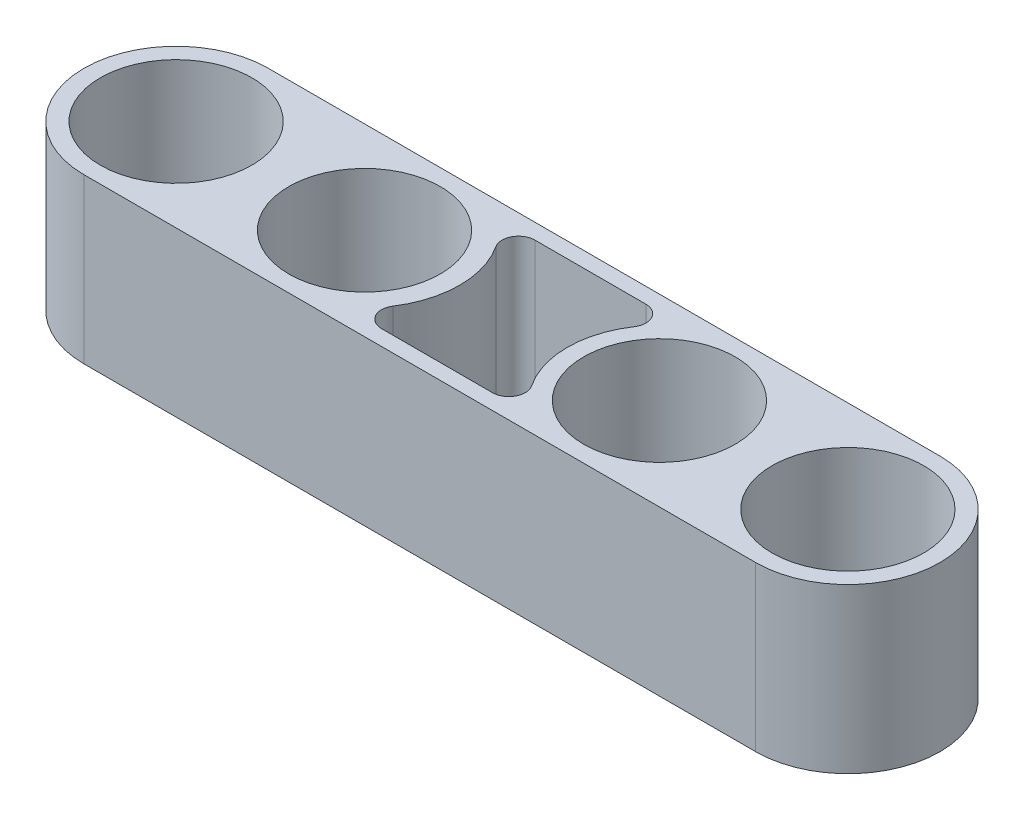
ISO-10303-21;
HEADER;
FILE_DESCRIPTION(('STEP AP214'),'2;1');
FILE_NAME('part.step','',(''),(''),'','','');
FILE_SCHEMA(('AUTOMOTIVE_DESIGN { 1 0 10303 214 1 1 1 1 }'));
ENDSEC;
DATA;
#1=APPLICATION_CONTEXT('core data for automotive mechanical design processes');
#2=APPLICATION_PROTOCOL_DEFINITION('international standard','automotive_design',2000,#1);
#3=PRODUCT_CONTEXT('',#1,'mechanical');
#4=PRODUCT('Part','Part','',(#3));
#5=PRODUCT_RELATED_PRODUCT_CATEGORY('part','',(#4));
#6=PRODUCT_DEFINITION_FORMATION('','',#4);
#7=PRODUCT_DEFINITION_CONTEXT('part definition',#1,'design');
#8=PRODUCT_DEFINITION('design','',#6,#7);
#9=PRODUCT_DEFINITION_SHAPE('','',#8);
#10=(LENGTH_UNIT() NAMED_UNIT(*) SI_UNIT(.MILLI.,.METRE.));
#11=(NAMED_UNIT(*) PLANE_ANGLE_UNIT() SI_UNIT($,.RADIAN.));
#12=(NAMED_UNIT(*) SI_UNIT($,.STERADIAN.) SOLID_ANGLE_UNIT());
#13=UNCERTAINTY_MEASURE_WITH_UNIT(LENGTH_MEASURE(1.E-05),#10,'distance_accuracy_value','');
#14=(GEOMETRIC_REPRESENTATION_CONTEXT(3) GLOBAL_UNCERTAINTY_ASSIGNED_CONTEXT((#13)) GLOBAL_UNIT_ASSIGNED_CONTEXT((#10,
#11,#12)) REPRESENTATION_CONTEXT('',''));
#15=CARTESIAN_POINT('',(0.,0.,0.));
#16=DIRECTION('',(0.,0.,1.));
#17=DIRECTION('',(1.,0.,0.));
#18=AXIS2_PLACEMENT_3D('',#15,#16,#17);
#19=CARTESIAN_POINT('',(-17.8836964666493,20.,0.));
#20=DIRECTION('',(0.,-1.,0.));
#21=DIRECTION('',(0.,0.,-1.));
#22=AXIS2_PLACEMENT_3D('',#19,#20,#21);
#23=CYLINDRICAL_SURFACE('',#22,11.5);
#24=CARTESIAN_POINT('',(-17.8836964666493,0.,0.));
#25=DIRECTION('',(0.,1.,0.));
#26=DIRECTION('',(0.,0.,1.));
#27=AXIS2_PLACEMENT_3D('',#24,#25,#26);
#28=CIRCLE('',#27,11.5);
#29=CARTESIAN_POINT('',(-8.24368220438211,0.,6.27057613168724));
#30=VERTEX_POINT('',#29);
#31=CARTESIAN_POINT('',(-8.24368220438213,0.,-6.27057613168725));
#32=VERTEX_POINT('',#31);
#33=EDGE_CURVE('E188',#30,#32,#28,.T.);
#34=ORIENTED_EDGE('',*,*,#33,.T.);
#35=DIRECTION('',(0.,-1.,0.));
#36=VECTOR('',#35,1.);
#37=CARTESIAN_POINT('',(-8.24368220438213,20.,-6.27057613168725));
#38=LINE('',#37,#36);
#39=CARTESIAN_POINT('',(-8.24368220438213,20.,-6.27057613168725));
#40=VERTEX_POINT('',#39);
#41=EDGE_CURVE('E11',#40,#32,#38,.T.);
#42=ORIENTED_EDGE('',*,*,#41,.F.);
#43=CARTESIAN_POINT('',(-17.8836964666493,20.,0.));
#44=DIRECTION('',(0.,1.,0.));
#45=DIRECTION('',(0.,0.,1.));
#46=AXIS2_PLACEMENT_3D('',#43,#44,#45);
#47=CIRCLE('',#46,11.5);
#48=CARTESIAN_POINT('',(-8.24368220438211,20.,6.27057613168724));
#49=VERTEX_POINT('',#48);
#50=EDGE_CURVE('E243',#49,#40,#47,.T.);
#51=ORIENTED_EDGE('',*,*,#50,.F.);
#52=DIRECTION('',(0.,-1.,0.));
#53=VECTOR('',#52,1.);
#54=CARTESIAN_POINT('',(-8.24368220438211,20.,6.27057613168724));
#55=LINE('',#54,#53);
#56=EDGE_CURVE('E207',#49,#30,#55,.T.);
#57=ORIENTED_EDGE('',*,*,#56,.T.);
#58=EDGE_LOOP('',(#34,#42,#51,#57));
#59=FACE_BOUND('',#58,.T.);
#60=ADVANCED_FACE('F41',(#59),#23,.T.);
#61=CARTESIAN_POINT('',(-6.56715798485741,20.,-7.36111111111112));
#62=DIRECTION('',(0.,-1.,0.));
#63=DIRECTION('',(0.,0.,-1.));
#64=AXIS2_PLACEMENT_3D('',#61,#62,#63);
#65=CYLINDRICAL_SURFACE('',#64,2.);
#66=CARTESIAN_POINT('',(-6.56715798485741,0.,-7.36111111111112));
#67=DIRECTION('',(0.,1.,0.));
#68=DIRECTION('',(0.,0.,1.));
#69=AXIS2_PLACEMENT_3D('',#66,#67,#68);
#70=CIRCLE('',#69,2.);
#71=CARTESIAN_POINT('',(-6.56715798485741,0.,-9.36111111111112));
#72=VERTEX_POINT('',#71);
#73=EDGE_CURVE('E191',#32,#72,#70,.F.);
#74=ORIENTED_EDGE('',*,*,#73,.T.);
#75=DIRECTION('',(0.,-1.,0.));
#76=VECTOR('',#75,1.);
#77=CARTESIAN_POINT('',(-6.56715798485741,20.,-9.36111111111112));
#78=LINE('',#77,#76);
#79=CARTESIAN_POINT('',(-6.56715798485741,20.,-9.36111111111112));
#80=VERTEX_POINT('',#79);
#81=EDGE_CURVE('E51',#80,#72,#78,.T.);
#82=ORIENTED_EDGE('',*,*,#81,.F.);
#83=CARTESIAN_POINT('',(-6.56715798485741,20.,-7.36111111111112));
#84=DIRECTION('',(0.,1.,0.));
#85=DIRECTION('',(0.,0.,1.));
#86=AXIS2_PLACEMENT_3D('',#83,#84,#85);
#87=CIRCLE('',#86,2.);
#88=EDGE_CURVE('E251',#40,#80,#87,.F.);
#89=ORIENTED_EDGE('',*,*,#88,.F.);
#90=ORIENTED_EDGE('',*,*,#41,.T.);
#91=EDGE_LOOP('',(#74,#82,#89,#90));
#92=FACE_BOUND('',#91,.T.);
#93=ADVANCED_FACE('F279',(#92),#65,.F.);
#94=CARTESIAN_POINT('',(0.,20.,-9.36111111111112));
#95=DIRECTION('',(0.,0.,-1.));
#96=DIRECTION('',(-1.,0.,0.));
#97=AXIS2_PLACEMENT_3D('',#94,#95,#96);
#98=PLANE('',#97);
#99=DIRECTION('',(1.,0.,0.));
#100=VECTOR('',#99,1.);
#101=CARTESIAN_POINT('',(0.,0.,-9.36111111111112));
#102=LINE('',#101,#100);
#103=CARTESIAN_POINT('',(6.98289769449895,0.,-9.36111111111112));
#104=VERTEX_POINT('',#103);
#105=EDGE_CURVE('E193',#72,#104,#102,.T.);
#106=ORIENTED_EDGE('',*,*,#105,.T.);
#107=DIRECTION('',(0.,-1.,0.));
#108=VECTOR('',#107,1.);
#109=CARTESIAN_POINT('',(6.98289769449895,20.,-9.36111111111112));
#110=LINE('',#109,#108);
#111=CARTESIAN_POINT('',(6.98289769449895,20.,-9.36111111111112));
#112=VERTEX_POINT('',#111);
#113=EDGE_CURVE('E213',#112,#104,#110,.T.);
#114=ORIENTED_EDGE('',*,*,#113,.F.);
#115=DIRECTION('',(1.,0.,0.));
#116=VECTOR('',#115,1.);
#117=CARTESIAN_POINT('',(0.,20.,-9.36111111111112));
#118=LINE('',#117,#116);
#119=EDGE_CURVE('E253',#80,#112,#118,.T.);
#120=ORIENTED_EDGE('',*,*,#119,.F.);
#121=ORIENTED_EDGE('',*,*,#81,.T.);
#122=EDGE_LOOP('',(#106,#114,#120,#121));
#123=FACE_BOUND('',#122,.T.);
#124=ADVANCED_FACE('F264',(#123),#98,.F.);
#125=CARTESIAN_POINT('',(6.98289769449895,20.,-7.36111111111112));
#126=DIRECTION('',(0.,-1.,0.));
#127=DIRECTION('',(0.,0.,-1.));
#128=AXIS2_PLACEMENT_3D('',#125,#126,#127);
#129=CYLINDRICAL_SURFACE('',#128,2.);
#130=CARTESIAN_POINT('',(6.98289769449895,0.,-7.36111111111112));
#131=DIRECTION('',(0.,1.,0.));
#132=DIRECTION('',(0.,0.,1.));
#133=AXIS2_PLACEMENT_3D('',#130,#131,#132);
#134=CIRCLE('',#133,2.);
#135=CARTESIAN_POINT('',(8.64585653306515,0.,-6.25000000000002));
#136=VERTEX_POINT('',#135);
#137=EDGE_CURVE('E196',#136,#104,#134,.T.);
#138=ORIENTED_EDGE('',*,*,#137,.F.);
#139=DIRECTION('',(0.,-1.,0.));
#140=VECTOR('',#139,1.);
#141=CARTESIAN_POINT('',(8.64585653306515,20.,-6.25000000000002));
#142=LINE('',#141,#140);
#143=CARTESIAN_POINT('',(8.64585653306515,20.,-6.25000000000002));
#144=VERTEX_POINT('',#143);
#145=EDGE_CURVE('E211',#144,#136,#142,.T.);
#146=ORIENTED_EDGE('',*,*,#145,.F.);
#147=CARTESIAN_POINT('',(6.98289769449895,20.,-7.36111111111112));
#148=DIRECTION('',(0.,1.,0.));
#149=DIRECTION('',(0.,0.,1.));
#150=AXIS2_PLACEMENT_3D('',#147,#148,#149);
#151=CIRCLE('',#150,2.);
#152=EDGE_CURVE('E255',#144,#112,#151,.T.);
#153=ORIENTED_EDGE('',*,*,#152,.T.);
#154=ORIENTED_EDGE('',*,*,#113,.T.);
#155=EDGE_LOOP('',(#138,#146,#153,#154));
#156=FACE_BOUND('',#155,.T.);
#157=ADVANCED_FACE('F259',(#156),#129,.F.);
#158=CARTESIAN_POINT('',(18.,20.,0.));
#159=DIRECTION('',(0.,-1.,0.));
#160=DIRECTION('',(0.,0.,-1.));
#161=AXIS2_PLACEMENT_3D('',#158,#159,#160);
#162=CYLINDRICAL_SURFACE('',#161,11.25);
#163=CARTESIAN_POINT('',(18.,0.,0.));
#164=DIRECTION('',(0.,1.,0.));
#165=DIRECTION('',(0.,0.,1.));
#166=AXIS2_PLACEMENT_3D('',#163,#164,#165);
#167=CIRCLE('',#166,11.25);
#168=CARTESIAN_POINT('',(8.64585653306514,0.,6.24999999999999));
#169=VERTEX_POINT('',#168);
#170=EDGE_CURVE('E199',#136,#169,#167,.T.);
#171=ORIENTED_EDGE('',*,*,#170,.T.);
#172=DIRECTION('',(0.,-1.,0.));
#173=VECTOR('',#172,1.);
#174=CARTESIAN_POINT('',(8.64585653306514,20.,6.24999999999999));
#175=LINE('',#174,#173);
#176=CARTESIAN_POINT('',(8.64585653306514,20.,6.24999999999999));
#177=VERTEX_POINT('',#176);
#178=EDGE_CURVE('E150',#177,#169,#175,.T.);
#179=ORIENTED_EDGE('',*,*,#178,.F.);
#180=CARTESIAN_POINT('',(18.,20.,0.));
#181=DIRECTION('',(0.,1.,0.));
#182=DIRECTION('',(0.,0.,1.));
#183=AXIS2_PLACEMENT_3D('',#180,#181,#182);
#184=CIRCLE('',#183,11.25);
#185=EDGE_CURVE('E156',#144,#177,#184,.T.);
#186=ORIENTED_EDGE('',*,*,#185,.F.);
#187=ORIENTED_EDGE('',*,*,#145,.T.);
#188=EDGE_LOOP('',(#171,#179,#186,#187));
#189=FACE_BOUND('',#188,.T.);
#190=ADVANCED_FACE('F269',(#189),#162,.T.);
#191=CARTESIAN_POINT('',(6.98289769449895,20.,7.3611111111111));
#192=DIRECTION('',(0.,-1.,0.));
#193=DIRECTION('',(0.,0.,-1.));
#194=AXIS2_PLACEMENT_3D('',#191,#192,#193);
#195=CYLINDRICAL_SURFACE('',#194,2.);
#196=CARTESIAN_POINT('',(6.98289769449895,0.,7.3611111111111));
#197=DIRECTION('',(0.,1.,0.));
#198=DIRECTION('',(0.,0.,1.));
#199=AXIS2_PLACEMENT_3D('',#196,#197,#198);
#200=CIRCLE('',#199,2.);
#201=CARTESIAN_POINT('',(6.98289769449895,0.,9.3611111111111));
#202=VERTEX_POINT('',#201);
#203=EDGE_CURVE('E145',#202,#169,#200,.T.);
#204=ORIENTED_EDGE('',*,*,#203,.F.);
#205=DIRECTION('',(0.,-1.,0.));
#206=VECTOR('',#205,1.);
#207=CARTESIAN_POINT('',(6.98289769449895,20.,9.3611111111111));
#208=LINE('',#207,#206);
#209=CARTESIAN_POINT('',(6.98289769449895,20.,9.3611111111111));
#210=VERTEX_POINT('',#209);
#211=EDGE_CURVE('E140',#210,#202,#208,.T.);
#212=ORIENTED_EDGE('',*,*,#211,.F.);
#213=CARTESIAN_POINT('',(6.98289769449895,20.,7.3611111111111));
#214=DIRECTION('',(0.,1.,0.));
#215=DIRECTION('',(0.,0.,1.));
#216=AXIS2_PLACEMENT_3D('',#213,#214,#215);
#217=CIRCLE('',#216,2.);
#218=EDGE_CURVE('E143',#210,#177,#217,.T.);
#219=ORIENTED_EDGE('',*,*,#218,.T.);
#220=ORIENTED_EDGE('',*,*,#178,.T.);
#221=EDGE_LOOP('',(#204,#212,#219,#220));
#222=FACE_BOUND('',#221,.T.);
#223=ADVANCED_FACE('F142',(#222),#195,.F.);
#224=CARTESIAN_POINT('',(0.,20.,9.3611111111111));
#225=DIRECTION('',(0.,0.,-1.));
#226=DIRECTION('',(-1.,0.,0.));
#227=AXIS2_PLACEMENT_3D('',#224,#225,#226);
#228=PLANE('',#227);
#229=DIRECTION('',(1.,0.,0.));
#230=VECTOR('',#229,1.);
#231=CARTESIAN_POINT('',(0.,0.,9.3611111111111));
#232=LINE('',#231,#230);
#233=CARTESIAN_POINT('',(-6.56715798485738,0.,9.3611111111111));
#234=VERTEX_POINT('',#233);
#235=EDGE_CURVE('E203',#234,#202,#232,.T.);
#236=ORIENTED_EDGE('',*,*,#235,.F.);
#237=DIRECTION('',(0.,-1.,0.));
#238=VECTOR('',#237,1.);
#239=CARTESIAN_POINT('',(-6.56715798485738,20.,9.3611111111111));
#240=LINE('',#239,#238);
#241=CARTESIAN_POINT('',(-6.56715798485738,20.,9.3611111111111));
#242=VERTEX_POINT('',#241);
#243=EDGE_CURVE('E100',#242,#234,#240,.T.);
#244=ORIENTED_EDGE('',*,*,#243,.F.);
#245=DIRECTION('',(1.,0.,0.));
#246=VECTOR('',#245,1.);
#247=CARTESIAN_POINT('',(0.,20.,9.3611111111111));
#248=LINE('',#247,#246);
#249=EDGE_CURVE('E153',#242,#210,#248,.T.);
#250=ORIENTED_EDGE('',*,*,#249,.T.);
#251=ORIENTED_EDGE('',*,*,#211,.T.);
#252=EDGE_LOOP('',(#236,#244,#250,#251));
#253=FACE_BOUND('',#252,.T.);
#254=ADVANCED_FACE('F159',(#253),#228,.T.);
#255=CARTESIAN_POINT('',(0.,20.,11.25));
#256=DIRECTION('',(0.,0.,-1.));
#257=DIRECTION('',(-1.,0.,0.));
#258=AXIS2_PLACEMENT_3D('',#255,#256,#257);
#259=PLANE('',#258);
#260=DIRECTION('',(1.,0.,0.));
#261=VECTOR('',#260,1.);
#262=CARTESIAN_POINT('',(0.,0.,11.25));
#263=LINE('',#262,#261);
#264=CARTESIAN_POINT('',(-41.,0.,11.25));
#265=VERTEX_POINT('',#264);
#266=CARTESIAN_POINT('',(41.,0.,11.25));
#267=VERTEX_POINT('',#266);
#268=EDGE_CURVE('E177',#265,#267,#263,.T.);
#269=ORIENTED_EDGE('',*,*,#268,.T.);
#270=DIRECTION('',(0.,-1.,0.));
#271=VECTOR('',#270,1.);
#272=CARTESIAN_POINT('',(41.,20.,11.25));
#273=LINE('',#272,#271);
#274=CARTESIAN_POINT('',(41.,20.,11.25));
#275=VERTEX_POINT('',#274);
#276=EDGE_CURVE('E45',#275,#267,#273,.T.);
#277=ORIENTED_EDGE('',*,*,#276,.F.);
#278=DIRECTION('',(1.,0.,0.));
#279=VECTOR('',#278,1.);
#280=CARTESIAN_POINT('',(0.,20.,11.25));
#281=LINE('',#280,#279);
#282=CARTESIAN_POINT('',(-41.,20.,11.25));
#283=VERTEX_POINT('',#282);
#284=EDGE_CURVE('E246',#283,#275,#281,.T.);
#285=ORIENTED_EDGE('',*,*,#284,.F.);
#286=DIRECTION('',(0.,-1.,0.));
#287=VECTOR('',#286,1.);
#288=CARTESIAN_POINT('',(-41.,20.,11.25));
#289=LINE('',#288,#287);
#290=EDGE_CURVE('E161',#283,#265,#289,.T.);
#291=ORIENTED_EDGE('',*,*,#290,.T.);
#292=EDGE_LOOP('',(#269,#277,#285,#291));
#293=FACE_BOUND('',#292,.T.);
#294=ADVANCED_FACE('F229',(#293),#259,.F.);
#295=CARTESIAN_POINT('',(41.,20.,0.));
#296=DIRECTION('',(0.,-1.,0.));
#297=DIRECTION('',(0.,0.,-1.));
#298=AXIS2_PLACEMENT_3D('',#295,#296,#297);
#299=CYLINDRICAL_SURFACE('',#298,11.25);
#300=CARTESIAN_POINT('',(41.,0.,0.));
#301=DIRECTION('',(0.,1.,0.));
#302=DIRECTION('',(0.,0.,1.));
#303=AXIS2_PLACEMENT_3D('',#300,#301,#302);
#304=CIRCLE('',#303,11.25);
#305=CARTESIAN_POINT('',(41.,0.,-11.25));
#306=VERTEX_POINT('',#305);
#307=EDGE_CURVE('E180',#267,#306,#304,.T.);
#308=ORIENTED_EDGE('',*,*,#307,.T.);
#309=DIRECTION('',(0.,-1.,0.));
#310=VECTOR('',#309,1.);
#311=CARTESIAN_POINT('',(41.,20.,-11.25));
#312=LINE('',#311,#310);
#313=CARTESIAN_POINT('',(41.,20.,-11.25));
#314=VERTEX_POINT('',#313);
#315=EDGE_CURVE('E220',#314,#306,#312,.T.);
#316=ORIENTED_EDGE('',*,*,#315,.F.);
#317=CARTESIAN_POINT('',(41.,20.,0.));
#318=DIRECTION('',(0.,1.,0.));
#319=DIRECTION('',(0.,0.,1.));
#320=AXIS2_PLACEMENT_3D('',#317,#318,#319);
#321=CIRCLE('',#320,11.25);
#322=EDGE_CURVE('E112',#275,#314,#321,.T.);
#323=ORIENTED_EDGE('',*,*,#322,.F.);
#324=ORIENTED_EDGE('',*,*,#276,.T.);
#325=EDGE_LOOP('',(#308,#316,#323,#324));
#326=FACE_BOUND('',#325,.T.);
#327=ADVANCED_FACE('F225',(#326),#299,.T.);
#328=CARTESIAN_POINT('',(0.,20.,-11.25));
#329=DIRECTION('',(0.,0.,-1.));
#330=DIRECTION('',(-1.,0.,0.));
#331=AXIS2_PLACEMENT_3D('',#328,#329,#330);
#332=PLANE('',#331);
#333=DIRECTION('',(1.,0.,0.));
#334=VECTOR('',#333,1.);
#335=CARTESIAN_POINT('',(0.,0.,-11.25));
#336=LINE('',#335,#334);
#337=CARTESIAN_POINT('',(-41.,0.,-11.25));
#338=VERTEX_POINT('',#337);
#339=EDGE_CURVE('E183',#338,#306,#336,.T.);
#340=ORIENTED_EDGE('',*,*,#339,.F.);
#341=DIRECTION('',(0.,-1.,0.));
#342=VECTOR('',#341,1.);
#343=CARTESIAN_POINT('',(-41.,20.,-11.25));
#344=LINE('',#343,#342);
#345=CARTESIAN_POINT('',(-41.,20.,-11.25));
#346=VERTEX_POINT('',#345);
#347=EDGE_CURVE('E219',#346,#338,#344,.T.);
#348=ORIENTED_EDGE('',*,*,#347,.F.);
#349=DIRECTION('',(1.,0.,0.));
#350=VECTOR('',#349,1.);
#351=CARTESIAN_POINT('',(0.,20.,-11.25));
#352=LINE('',#351,#350);
#353=EDGE_CURVE('E238',#346,#314,#352,.T.);
#354=ORIENTED_EDGE('',*,*,#353,.T.);
#355=ORIENTED_EDGE('',*,*,#315,.T.);
#356=EDGE_LOOP('',(#340,#348,#354,#355));
#357=FACE_BOUND('',#356,.T.);
#358=ADVANCED_FACE('F235',(#357),#332,.T.);
#359=CARTESIAN_POINT('',(-41.,20.,0.));
#360=DIRECTION('',(0.,-1.,0.));
#361=DIRECTION('',(0.,0.,-1.));
#362=AXIS2_PLACEMENT_3D('',#359,#360,#361);
#363=CYLINDRICAL_SURFACE('',#362,11.25);
#364=CARTESIAN_POINT('',(-41.,0.,0.));
#365=DIRECTION('',(0.,1.,0.));
#366=DIRECTION('',(0.,0.,1.));
#367=AXIS2_PLACEMENT_3D('',#364,#365,#366);
#368=CIRCLE('',#367,11.25);
#369=EDGE_CURVE('E186',#338,#265,#368,.T.);
#370=ORIENTED_EDGE('',*,*,#369,.T.);
#371=ORIENTED_EDGE('',*,*,#290,.F.);
#372=CARTESIAN_POINT('',(-41.,20.,0.));
#373=DIRECTION('',(0.,1.,0.));
#374=DIRECTION('',(0.,0.,1.));
#375=AXIS2_PLACEMENT_3D('',#372,#373,#374);
#376=CIRCLE('',#375,11.25);
#377=EDGE_CURVE('E240',#346,#283,#376,.T.);
#378=ORIENTED_EDGE('',*,*,#377,.F.);
#379=ORIENTED_EDGE('',*,*,#347,.T.);
#380=EDGE_LOOP('',(#370,#371,#378,#379));
#381=FACE_BOUND('',#380,.T.);
#382=ADVANCED_FACE('F241',(#381),#363,.T.);
#383=CARTESIAN_POINT('',(41.,20.,0.));
#384=DIRECTION('',(0.,-1.,0.));
#385=DIRECTION('',(0.,0.,-1.));
#386=AXIS2_PLACEMENT_3D('',#383,#384,#385);
#387=CYLINDRICAL_SURFACE('',#386,9.25);
#388=CARTESIAN_POINT('',(41.,20.,0.));
#389=DIRECTION('',(0.,1.,0.));
#390=DIRECTION('',(0.,0.,1.));
#391=AXIS2_PLACEMENT_3D('',#388,#389,#390);
#392=CIRCLE('',#391,9.25);
#393=CARTESIAN_POINT('',(41.,20.,9.24999999999999));
#394=VERTEX_POINT('',#393);
#395=EDGE_CURVE('E473',#394,#394,#392,.T.);
#396=ORIENTED_EDGE('',*,*,#395,.T.);
#397=EDGE_LOOP('',(#396));
#398=FACE_BOUND('',#397,.T.);
#399=CARTESIAN_POINT('',(41.,0.,0.));
#400=DIRECTION('',(0.,1.,0.));
#401=DIRECTION('',(0.,0.,1.));
#402=AXIS2_PLACEMENT_3D('',#399,#400,#401);
#403=CIRCLE('',#402,9.25);
#404=CARTESIAN_POINT('',(41.,0.,9.24999999999999));
#405=VERTEX_POINT('',#404);
#406=EDGE_CURVE('E174',#405,#405,#403,.T.);
#407=ORIENTED_EDGE('',*,*,#406,.F.);
#408=EDGE_LOOP('',(#407));
#409=FACE_BOUND('',#408,.T.);
#410=ADVANCED_FACE('F291',(#398,#409),#387,.F.);
#411=CARTESIAN_POINT('',(18.,20.,0.));
#412=DIRECTION('',(0.,-1.,0.));
#413=DIRECTION('',(0.,0.,-1.));
#414=AXIS2_PLACEMENT_3D('',#411,#412,#413);
#415=CYLINDRICAL_SURFACE('',#414,9.25);
#416=CARTESIAN_POINT('',(18.,20.,0.));
#417=DIRECTION('',(0.,1.,0.));
#418=DIRECTION('',(0.,0.,1.));
#419=AXIS2_PLACEMENT_3D('',#416,#417,#418);
#420=CIRCLE('',#419,9.25);
#421=CARTESIAN_POINT('',(18.,20.,9.24999999999999));
#422=VERTEX_POINT('',#421);
#423=EDGE_CURVE('E470',#422,#422,#420,.T.);
#424=ORIENTED_EDGE('',*,*,#423,.T.);
#425=EDGE_LOOP('',(#424));
#426=FACE_BOUND('',#425,.T.);
#427=CARTESIAN_POINT('',(18.,0.,0.));
#428=DIRECTION('',(0.,1.,0.));
#429=DIRECTION('',(0.,0.,1.));
#430=AXIS2_PLACEMENT_3D('',#427,#428,#429);
#431=CIRCLE('',#430,9.25);
#432=CARTESIAN_POINT('',(18.,0.,9.24999999999999));
#433=VERTEX_POINT('',#432);
#434=EDGE_CURVE('E171',#433,#433,#431,.T.);
#435=ORIENTED_EDGE('',*,*,#434,.F.);
#436=EDGE_LOOP('',(#435));
#437=FACE_BOUND('',#436,.T.);
#438=ADVANCED_FACE('F300',(#426,#437),#415,.F.);
#439=CARTESIAN_POINT('',(-18.,20.,0.));
#440=DIRECTION('',(0.,-1.,0.));
#441=DIRECTION('',(0.,0.,-1.));
#442=AXIS2_PLACEMENT_3D('',#439,#440,#441);
#443=CYLINDRICAL_SURFACE('',#442,9.25);
#444=CARTESIAN_POINT('',(-18.,20.,0.));
#445=DIRECTION('',(0.,1.,0.));
#446=DIRECTION('',(0.,0.,1.));
#447=AXIS2_PLACEMENT_3D('',#444,#445,#446);
#448=CIRCLE('',#447,9.25);
#449=CARTESIAN_POINT('',(-18.,20.,9.25));
#450=VERTEX_POINT('',#449);
#451=EDGE_CURVE('E315',#450,#450,#448,.T.);
#452=ORIENTED_EDGE('',*,*,#451,.T.);
#453=EDGE_LOOP('',(#452));
#454=FACE_BOUND('',#453,.T.);
#455=CARTESIAN_POINT('',(-18.,0.,0.));
#456=DIRECTION('',(0.,1.,0.));
#457=DIRECTION('',(0.,0.,1.));
#458=AXIS2_PLACEMENT_3D('',#455,#456,#457);
#459=CIRCLE('',#458,9.25);
#460=CARTESIAN_POINT('',(-18.,0.,9.25));
#461=VERTEX_POINT('',#460);
#462=EDGE_CURVE('E168',#461,#461,#459,.T.);
#463=ORIENTED_EDGE('',*,*,#462,.F.);
#464=EDGE_LOOP('',(#463));
#465=FACE_BOUND('',#464,.T.);
#466=ADVANCED_FACE('F303',(#454,#465),#443,.F.);
#467=CARTESIAN_POINT('',(-41.,20.,0.));
#468=DIRECTION('',(0.,-1.,0.));
#469=DIRECTION('',(0.,0.,-1.));
#470=AXIS2_PLACEMENT_3D('',#467,#468,#469);
#471=CYLINDRICAL_SURFACE('',#470,9.25);
#472=CARTESIAN_POINT('',(-41.,20.,0.));
#473=DIRECTION('',(0.,1.,0.));
#474=DIRECTION('',(0.,0.,1.));
#475=AXIS2_PLACEMENT_3D('',#472,#473,#474);
#476=CIRCLE('',#475,9.25);
#477=CARTESIAN_POINT('',(-41.,20.,9.25));
#478=VERTEX_POINT('',#477);
#479=EDGE_CURVE('E206',#478,#478,#476,.T.);
#480=ORIENTED_EDGE('',*,*,#479,.T.);
#481=EDGE_LOOP('',(#480));
#482=FACE_BOUND('',#481,.T.);
#483=CARTESIAN_POINT('',(-41.,0.,0.));
#484=DIRECTION('',(0.,1.,0.));
#485=DIRECTION('',(0.,0.,1.));
#486=AXIS2_PLACEMENT_3D('',#483,#484,#485);
#487=CIRCLE('',#486,9.25);
#488=CARTESIAN_POINT('',(-41.,0.,9.25));
#489=VERTEX_POINT('',#488);
#490=EDGE_CURVE('E165',#489,#489,#487,.T.);
#491=ORIENTED_EDGE('',*,*,#490,.F.);
#492=EDGE_LOOP('',(#491));
#493=FACE_BOUND('',#492,.T.);
#494=ADVANCED_FACE('F43',(#482,#493),#471,.F.);
#495=CARTESIAN_POINT('',(-6.56715798485738,20.,7.3611111111111));
#496=DIRECTION('',(0.,-1.,0.));
#497=DIRECTION('',(0.,0.,-1.));
#498=AXIS2_PLACEMENT_3D('',#495,#496,#497);
#499=CYLINDRICAL_SURFACE('',#498,2.);
#500=CARTESIAN_POINT('',(-6.56715798485738,0.,7.3611111111111));
#501=DIRECTION('',(0.,1.,0.));
#502=DIRECTION('',(0.,0.,1.));
#503=AXIS2_PLACEMENT_3D('',#500,#501,#502);
#504=CIRCLE('',#503,2.);
#505=EDGE_CURVE('E103',#234,#30,#504,.F.);
#506=ORIENTED_EDGE('',*,*,#505,.T.);
#507=ORIENTED_EDGE('',*,*,#56,.F.);
#508=CARTESIAN_POINT('',(-6.56715798485738,20.,7.3611111111111));
#509=DIRECTION('',(0.,1.,0.));
#510=DIRECTION('',(0.,0.,1.));
#511=AXIS2_PLACEMENT_3D('',#508,#509,#510);
#512=CIRCLE('',#511,2.);
#513=EDGE_CURVE('E60',#242,#49,#512,.F.);
#514=ORIENTED_EDGE('',*,*,#513,.F.);
#515=ORIENTED_EDGE('',*,*,#243,.T.);
#516=EDGE_LOOP('',(#506,#507,#514,#515));
#517=FACE_BOUND('',#516,.T.);
#518=ADVANCED_FACE('F310',(#517),#499,.F.);
#519=CARTESIAN_POINT('',(0.,20.,0.));
#520=DIRECTION('',(0.,1.,0.));
#521=DIRECTION('',(0.,0.,1.));
#522=AXIS2_PLACEMENT_3D('',#519,#520,#521);
#523=PLANE('',#522);
#524=ORIENTED_EDGE('',*,*,#479,.F.);
#525=EDGE_LOOP('',(#524));
#526=FACE_BOUND('',#525,.T.);
#527=ORIENTED_EDGE('',*,*,#451,.F.);
#528=EDGE_LOOP('',(#527));
#529=FACE_BOUND('',#528,.T.);
#530=ORIENTED_EDGE('',*,*,#423,.F.);
#531=EDGE_LOOP('',(#530));
#532=FACE_BOUND('',#531,.T.);
#533=ORIENTED_EDGE('',*,*,#395,.F.);
#534=EDGE_LOOP('',(#533));
#535=FACE_BOUND('',#534,.T.);
#536=ORIENTED_EDGE('',*,*,#284,.T.);
#537=ORIENTED_EDGE('',*,*,#322,.T.);
#538=ORIENTED_EDGE('',*,*,#353,.F.);
#539=ORIENTED_EDGE('',*,*,#377,.T.);
#540=EDGE_LOOP('',(#536,#537,#538,#539));
#541=FACE_BOUND('',#540,.T.);
#542=ORIENTED_EDGE('',*,*,#50,.T.);
#543=ORIENTED_EDGE('',*,*,#88,.T.);
#544=ORIENTED_EDGE('',*,*,#119,.T.);
#545=ORIENTED_EDGE('',*,*,#152,.F.);
#546=ORIENTED_EDGE('',*,*,#185,.T.);
#547=ORIENTED_EDGE('',*,*,#218,.F.);
#548=ORIENTED_EDGE('',*,*,#249,.F.);
#549=ORIENTED_EDGE('',*,*,#513,.T.);
#550=EDGE_LOOP('',(#542,#543,#544,#545,#546,#547,#548,#549));
#551=FACE_BOUND('',#550,.T.);
#552=ADVANCED_FACE('F152',(#526,#529,#532,#535,#541,#551),#523,.T.);
#553=CARTESIAN_POINT('',(0.,0.,0.));
#554=DIRECTION('',(0.,1.,0.));
#555=DIRECTION('',(0.,0.,1.));
#556=AXIS2_PLACEMENT_3D('',#553,#554,#555);
#557=PLANE('',#556);
#558=ORIENTED_EDGE('',*,*,#490,.T.);
#559=EDGE_LOOP('',(#558));
#560=FACE_BOUND('',#559,.T.);
#561=ORIENTED_EDGE('',*,*,#462,.T.);
#562=EDGE_LOOP('',(#561));
#563=FACE_BOUND('',#562,.T.);
#564=ORIENTED_EDGE('',*,*,#434,.T.);
#565=EDGE_LOOP('',(#564));
#566=FACE_BOUND('',#565,.T.);
#567=ORIENTED_EDGE('',*,*,#406,.T.);
#568=EDGE_LOOP('',(#567));
#569=FACE_BOUND('',#568,.T.);
#570=ORIENTED_EDGE('',*,*,#268,.F.);
#571=ORIENTED_EDGE('',*,*,#369,.F.);
#572=ORIENTED_EDGE('',*,*,#339,.T.);
#573=ORIENTED_EDGE('',*,*,#307,.F.);
#574=EDGE_LOOP('',(#570,#571,#572,#573));
#575=FACE_BOUND('',#574,.T.);
#576=ORIENTED_EDGE('',*,*,#33,.F.);
#577=ORIENTED_EDGE('',*,*,#505,.F.);
#578=ORIENTED_EDGE('',*,*,#235,.T.);
#579=ORIENTED_EDGE('',*,*,#203,.T.);
#580=ORIENTED_EDGE('',*,*,#170,.F.);
#581=ORIENTED_EDGE('',*,*,#137,.T.);
#582=ORIENTED_EDGE('',*,*,#105,.F.);
#583=ORIENTED_EDGE('',*,*,#73,.F.);
#584=EDGE_LOOP('',(#576,#577,#578,#579,#580,#581,#582,#583));
#585=FACE_BOUND('',#584,.T.);
#586=ADVANCED_FACE('F233',(#560,#563,#566,#569,#575,#585),#557,.F.);
#587=CLOSED_SHELL('',(#60,#93,#124,#157,#190,#223,#254,#294,#327,#358,#382,#410,#438,#466,#494,
#518,#552,#586));
#588=MANIFOLD_SOLID_BREP('B2',#587);
#589=ADVANCED_BREP_SHAPE_REPRESENTATION('',(#18,#588),#14);
#590=SHAPE_DEFINITION_REPRESENTATION(#9,#589);
ENDSEC;
END-ISO-10303-21;
